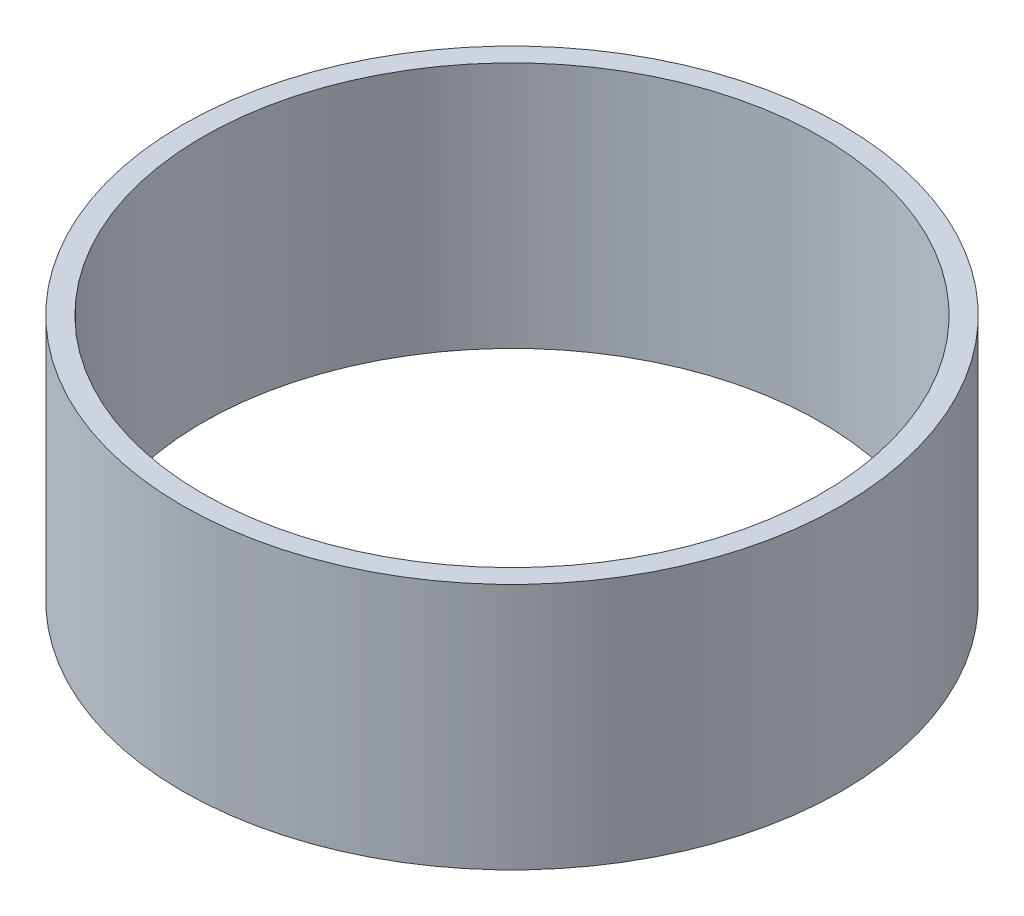
ISO-10303-21;
HEADER;
FILE_DESCRIPTION(('STEP AP214'),'2;1');
FILE_NAME('part.step','',(''),(''),'','','');
FILE_SCHEMA(('AUTOMOTIVE_DESIGN { 1 0 10303 214 1 1 1 1 }'));
ENDSEC;
DATA;
#1=APPLICATION_CONTEXT('core data for automotive mechanical design processes');
#2=APPLICATION_PROTOCOL_DEFINITION('international standard','automotive_design',2000,#1);
#3=PRODUCT_CONTEXT('',#1,'mechanical');
#4=PRODUCT('Part','Part','',(#3));
#5=PRODUCT_RELATED_PRODUCT_CATEGORY('part','',(#4));
#6=PRODUCT_DEFINITION_FORMATION('','',#4);
#7=PRODUCT_DEFINITION_CONTEXT('part definition',#1,'design');
#8=PRODUCT_DEFINITION('design','',#6,#7);
#9=PRODUCT_DEFINITION_SHAPE('','',#8);
#10=(LENGTH_UNIT() NAMED_UNIT(*) SI_UNIT(.MILLI.,.METRE.));
#11=(NAMED_UNIT(*) PLANE_ANGLE_UNIT() SI_UNIT($,.RADIAN.));
#12=(NAMED_UNIT(*) SI_UNIT($,.STERADIAN.) SOLID_ANGLE_UNIT());
#13=UNCERTAINTY_MEASURE_WITH_UNIT(LENGTH_MEASURE(1.E-05),#10,'distance_accuracy_value','');
#14=(GEOMETRIC_REPRESENTATION_CONTEXT(3) GLOBAL_UNCERTAINTY_ASSIGNED_CONTEXT((#13)) GLOBAL_UNIT_ASSIGNED_CONTEXT((#10,
#11,#12)) REPRESENTATION_CONTEXT('',''));
#15=CARTESIAN_POINT('',(0.,0.,0.));
#16=DIRECTION('',(0.,0.,1.));
#17=DIRECTION('',(1.,0.,0.));
#18=AXIS2_PLACEMENT_3D('',#15,#16,#17);
#19=CARTESIAN_POINT('',(0.,30.,0.));
#20=DIRECTION('',(0.,1.,0.));
#21=DIRECTION('',(0.,0.,1.));
#22=AXIS2_PLACEMENT_3D('',#19,#20,#21);
#23=PLANE('',#22);
#24=CARTESIAN_POINT('',(0.,30.,0.));
#25=DIRECTION('',(0.,1.,0.));
#26=DIRECTION('',(0.,0.,1.));
#27=AXIS2_PLACEMENT_3D('',#24,#25,#26);
#28=CIRCLE('',#27,40.);
#29=CARTESIAN_POINT('',(0.,30.,40.));
#30=VERTEX_POINT('',#29);
#31=EDGE_CURVE('E10',#30,#30,#28,.T.);
#32=ORIENTED_EDGE('',*,*,#31,.T.);
#33=EDGE_LOOP('',(#32));
#34=FACE_BOUND('',#33,.T.);
#35=CARTESIAN_POINT('',(0.,30.,0.));
#36=DIRECTION('',(0.,1.,0.));
#37=DIRECTION('',(0.,0.,1.));
#38=AXIS2_PLACEMENT_3D('',#35,#36,#37);
#39=CIRCLE('',#38,37.5);
#40=CARTESIAN_POINT('',(0.,30.,37.5));
#41=VERTEX_POINT('',#40);
#42=EDGE_CURVE('E47',#41,#41,#39,.T.);
#43=ORIENTED_EDGE('',*,*,#42,.F.);
#44=EDGE_LOOP('',(#43));
#45=FACE_BOUND('',#44,.T.);
#46=ADVANCED_FACE('F36',(#34,#45),#23,.T.);
#47=CARTESIAN_POINT('',(0.,0.,0.));
#48=DIRECTION('',(0.,1.,0.));
#49=DIRECTION('',(0.,0.,1.));
#50=AXIS2_PLACEMENT_3D('',#47,#48,#49);
#51=PLANE('',#50);
#52=CARTESIAN_POINT('',(0.,0.,0.));
#53=DIRECTION('',(0.,1.,0.));
#54=DIRECTION('',(0.,0.,1.));
#55=AXIS2_PLACEMENT_3D('',#52,#53,#54);
#56=CIRCLE('',#55,40.);
#57=CARTESIAN_POINT('',(0.,0.,40.));
#58=VERTEX_POINT('',#57);
#59=EDGE_CURVE('E40',#58,#58,#56,.T.);
#60=ORIENTED_EDGE('',*,*,#59,.F.);
#61=EDGE_LOOP('',(#60));
#62=FACE_BOUND('',#61,.T.);
#63=CARTESIAN_POINT('',(0.,0.,0.));
#64=DIRECTION('',(0.,1.,0.));
#65=DIRECTION('',(0.,0.,1.));
#66=AXIS2_PLACEMENT_3D('',#63,#64,#65);
#67=CIRCLE('',#66,37.5);
#68=CARTESIAN_POINT('',(0.,0.,37.5));
#69=VERTEX_POINT('',#68);
#70=EDGE_CURVE('E49',#69,#69,#67,.T.);
#71=ORIENTED_EDGE('',*,*,#70,.T.);
#72=EDGE_LOOP('',(#71));
#73=FACE_BOUND('',#72,.T.);
#74=ADVANCED_FACE('F59',(#62,#73),#51,.F.);
#75=CARTESIAN_POINT('',(0.,30.,0.));
#76=DIRECTION('',(0.,-1.,0.));
#77=DIRECTION('',(0.,0.,-1.));
#78=AXIS2_PLACEMENT_3D('',#75,#76,#77);
#79=CYLINDRICAL_SURFACE('',#78,40.);
#80=ORIENTED_EDGE('',*,*,#31,.F.);
#81=EDGE_LOOP('',(#80));
#82=FACE_BOUND('',#81,.T.);
#83=ORIENTED_EDGE('',*,*,#59,.T.);
#84=EDGE_LOOP('',(#83));
#85=FACE_BOUND('',#84,.T.);
#86=ADVANCED_FACE('F38',(#82,#85),#79,.T.);
#87=CARTESIAN_POINT('',(0.,30.,0.));
#88=DIRECTION('',(0.,-1.,0.));
#89=DIRECTION('',(0.,0.,-1.));
#90=AXIS2_PLACEMENT_3D('',#87,#88,#89);
#91=CYLINDRICAL_SURFACE('',#90,37.5);
#92=ORIENTED_EDGE('',*,*,#42,.T.);
#93=EDGE_LOOP('',(#92));
#94=FACE_BOUND('',#93,.T.);
#95=ORIENTED_EDGE('',*,*,#70,.F.);
#96=EDGE_LOOP('',(#95));
#97=FACE_BOUND('',#96,.T.);
#98=ADVANCED_FACE('F55',(#94,#97),#91,.F.);
#99=CLOSED_SHELL('',(#46,#74,#86,#98));
#100=MANIFOLD_SOLID_BREP('B2',#99);
#101=ADVANCED_BREP_SHAPE_REPRESENTATION('',(#18,#100),#14);
#102=SHAPE_DEFINITION_REPRESENTATION(#9,#101);
ENDSEC;
END-ISO-10303-21;
